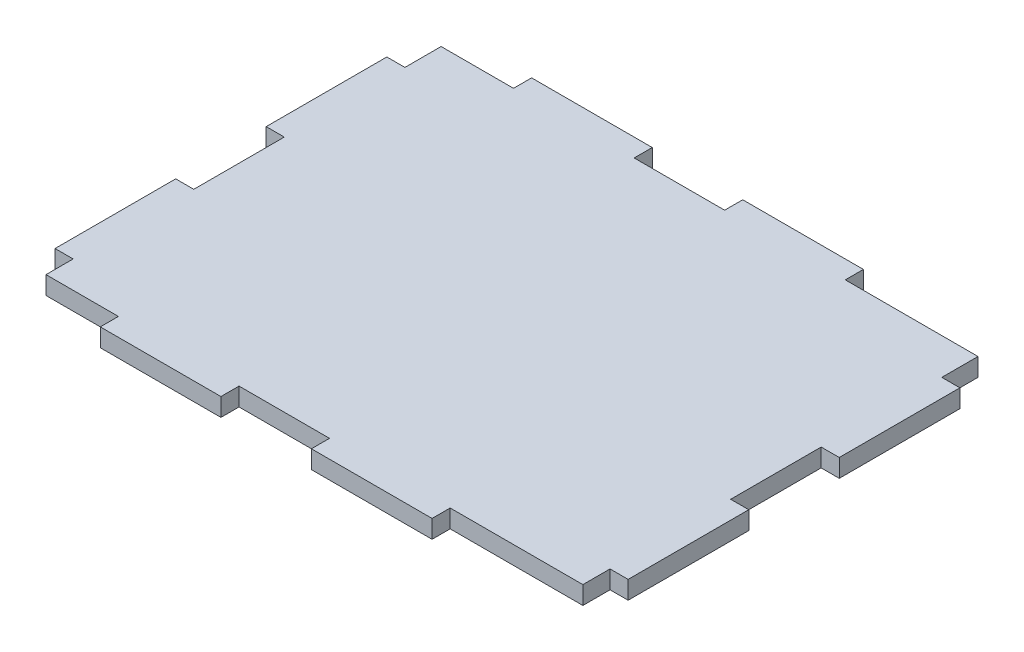
ISO-10303-21;
HEADER;
FILE_DESCRIPTION(('STEP AP214'),'2;1');
FILE_NAME('part.step','',(''),(''),'','','');
FILE_SCHEMA(('AUTOMOTIVE_DESIGN { 1 0 10303 214 1 1 1 1 }'));
ENDSEC;
DATA;
#1=APPLICATION_CONTEXT('core data for automotive mechanical design processes');
#2=APPLICATION_PROTOCOL_DEFINITION('international standard','automotive_design',2000,#1);
#3=PRODUCT_CONTEXT('',#1,'mechanical');
#4=PRODUCT('Part','Part','',(#3));
#5=PRODUCT_RELATED_PRODUCT_CATEGORY('part','',(#4));
#6=PRODUCT_DEFINITION_FORMATION('','',#4);
#7=PRODUCT_DEFINITION_CONTEXT('part definition',#1,'design');
#8=PRODUCT_DEFINITION('design','',#6,#7);
#9=PRODUCT_DEFINITION_SHAPE('','',#8);
#10=(LENGTH_UNIT() NAMED_UNIT(*) SI_UNIT(.MILLI.,.METRE.));
#11=(NAMED_UNIT(*) PLANE_ANGLE_UNIT() SI_UNIT($,.RADIAN.));
#12=(NAMED_UNIT(*) SI_UNIT($,.STERADIAN.) SOLID_ANGLE_UNIT());
#13=UNCERTAINTY_MEASURE_WITH_UNIT(LENGTH_MEASURE(1.E-05),#10,'distance_accuracy_value','');
#14=(GEOMETRIC_REPRESENTATION_CONTEXT(3) GLOBAL_UNCERTAINTY_ASSIGNED_CONTEXT((#13)) GLOBAL_UNIT_ASSIGNED_CONTEXT((#10,
#11,#12)) REPRESENTATION_CONTEXT('',''));
#15=CARTESIAN_POINT('',(0.,0.,0.));
#16=DIRECTION('',(0.,0.,1.));
#17=DIRECTION('',(1.,0.,0.));
#18=AXIS2_PLACEMENT_3D('',#15,#16,#17);
#19=CARTESIAN_POINT('',(89.,3.,0.));
#20=DIRECTION('',(-1.,0.,0.));
#21=DIRECTION('',(0.,0.,1.));
#22=AXIS2_PLACEMENT_3D('',#19,#20,#21);
#23=PLANE('',#22);
#24=DIRECTION('',(0.,0.,-1.));
#25=VECTOR('',#24,1.);
#26=CARTESIAN_POINT('',(89.,0.,0.));
#27=LINE('',#26,#25);
#28=CARTESIAN_POINT('',(89.,0.,0.));
#29=VERTEX_POINT('',#28);
#30=CARTESIAN_POINT('',(89.,0.,-4.50000000000002));
#31=VERTEX_POINT('',#30);
#32=EDGE_CURVE('E297',#29,#31,#27,.T.);
#33=ORIENTED_EDGE('',*,*,#32,.T.);
#34=DIRECTION('',(0.,-1.,0.));
#35=VECTOR('',#34,1.);
#36=CARTESIAN_POINT('',(89.,3.,-4.50000000000002));
#37=LINE('',#36,#35);
#38=CARTESIAN_POINT('',(89.,3.,-4.50000000000002));
#39=VERTEX_POINT('',#38);
#40=EDGE_CURVE('E11',#39,#31,#37,.T.);
#41=ORIENTED_EDGE('',*,*,#40,.F.);
#42=DIRECTION('',(0.,0.,-1.));
#43=VECTOR('',#42,1.);
#44=CARTESIAN_POINT('',(89.,3.,0.));
#45=LINE('',#44,#43);
#46=CARTESIAN_POINT('',(89.,3.,0.));
#47=VERTEX_POINT('',#46);
#48=EDGE_CURVE('E367',#47,#39,#45,.T.);
#49=ORIENTED_EDGE('',*,*,#48,.F.);
#50=DIRECTION('',(0.,-1.,0.));
#51=VECTOR('',#50,1.);
#52=CARTESIAN_POINT('',(89.,3.,0.));
#53=LINE('',#52,#51);
#54=EDGE_CURVE('E293',#47,#29,#53,.T.);
#55=ORIENTED_EDGE('',*,*,#54,.T.);
#56=EDGE_LOOP('',(#33,#41,#49,#55));
#57=FACE_BOUND('',#56,.T.);
#58=ADVANCED_FACE('F33',(#57),#23,.F.);
#59=CARTESIAN_POINT('',(89.,3.,-4.50000000000002));
#60=DIRECTION('',(0.,0.,-1.));
#61=DIRECTION('',(-1.,0.,0.));
#62=AXIS2_PLACEMENT_3D('',#59,#60,#61);
#63=PLANE('',#62);
#64=DIRECTION('',(1.,0.,0.));
#65=VECTOR('',#64,1.);
#66=CARTESIAN_POINT('',(89.,0.,-4.50000000000002));
#67=LINE('',#66,#65);
#68=CARTESIAN_POINT('',(92.,0.,-4.50000000000002));
#69=VERTEX_POINT('',#68);
#70=EDGE_CURVE('E300',#31,#69,#67,.T.);
#71=ORIENTED_EDGE('',*,*,#70,.T.);
#72=DIRECTION('',(0.,-1.,0.));
#73=VECTOR('',#72,1.);
#74=CARTESIAN_POINT('',(92.,3.,-4.50000000000002));
#75=LINE('',#74,#73);
#76=CARTESIAN_POINT('',(92.,3.,-4.50000000000002));
#77=VERTEX_POINT('',#76);
#78=EDGE_CURVE('E41',#77,#69,#75,.T.);
#79=ORIENTED_EDGE('',*,*,#78,.F.);
#80=DIRECTION('',(1.,0.,0.));
#81=VECTOR('',#80,1.);
#82=CARTESIAN_POINT('',(89.,3.,-4.50000000000002));
#83=LINE('',#82,#81);
#84=EDGE_CURVE('E176',#39,#77,#83,.T.);
#85=ORIENTED_EDGE('',*,*,#84,.F.);
#86=ORIENTED_EDGE('',*,*,#40,.T.);
#87=EDGE_LOOP('',(#71,#79,#85,#86));
#88=FACE_BOUND('',#87,.T.);
#89=ADVANCED_FACE('F565',(#88),#63,.F.);
#90=CARTESIAN_POINT('',(92.,3.,-4.50000000000002));
#91=DIRECTION('',(-1.,0.,0.));
#92=DIRECTION('',(0.,0.,1.));
#93=AXIS2_PLACEMENT_3D('',#90,#91,#92);
#94=PLANE('',#93);
#95=DIRECTION('',(0.,0.,-1.));
#96=VECTOR('',#95,1.);
#97=CARTESIAN_POINT('',(92.,0.,-4.50000000000002));
#98=LINE('',#97,#96);
#99=CARTESIAN_POINT('',(92.,0.,-24.5));
#100=VERTEX_POINT('',#99);
#101=EDGE_CURVE('E302',#69,#100,#98,.T.);
#102=ORIENTED_EDGE('',*,*,#101,.T.);
#103=DIRECTION('',(0.,-1.,0.));
#104=VECTOR('',#103,1.);
#105=CARTESIAN_POINT('',(92.,3.,-24.5));
#106=LINE('',#105,#104);
#107=CARTESIAN_POINT('',(92.,3.,-24.5));
#108=VERTEX_POINT('',#107);
#109=EDGE_CURVE('E458',#108,#100,#106,.T.);
#110=ORIENTED_EDGE('',*,*,#109,.F.);
#111=DIRECTION('',(0.,0.,-1.));
#112=VECTOR('',#111,1.);
#113=CARTESIAN_POINT('',(92.,3.,-4.50000000000002));
#114=LINE('',#113,#112);
#115=EDGE_CURVE('E466',#77,#108,#114,.T.);
#116=ORIENTED_EDGE('',*,*,#115,.F.);
#117=ORIENTED_EDGE('',*,*,#78,.T.);
#118=EDGE_LOOP('',(#102,#110,#116,#117));
#119=FACE_BOUND('',#118,.T.);
#120=ADVANCED_FACE('F464',(#119),#94,.F.);
#121=CARTESIAN_POINT('',(89.,3.,-24.5));
#122=DIRECTION('',(0.,0.,1.));
#123=DIRECTION('',(1.,0.,0.));
#124=AXIS2_PLACEMENT_3D('',#121,#122,#123);
#125=PLANE('',#124);
#126=DIRECTION('',(-1.,0.,0.));
#127=VECTOR('',#126,1.);
#128=CARTESIAN_POINT('',(89.,0.,-24.5));
#129=LINE('',#128,#127);
#130=CARTESIAN_POINT('',(89.,0.,-24.5));
#131=VERTEX_POINT('',#130);
#132=EDGE_CURVE('E304',#100,#131,#129,.T.);
#133=ORIENTED_EDGE('',*,*,#132,.T.);
#134=DIRECTION('',(0.,-1.,0.));
#135=VECTOR('',#134,1.);
#136=CARTESIAN_POINT('',(89.,3.,-24.5));
#137=LINE('',#136,#135);
#138=CARTESIAN_POINT('',(89.,3.,-24.5));
#139=VERTEX_POINT('',#138);
#140=EDGE_CURVE('E455',#139,#131,#137,.T.);
#141=ORIENTED_EDGE('',*,*,#140,.F.);
#142=DIRECTION('',(-1.,0.,0.));
#143=VECTOR('',#142,1.);
#144=CARTESIAN_POINT('',(89.,3.,-24.5));
#145=LINE('',#144,#143);
#146=EDGE_CURVE('E484',#108,#139,#145,.T.);
#147=ORIENTED_EDGE('',*,*,#146,.F.);
#148=ORIENTED_EDGE('',*,*,#109,.T.);
#149=EDGE_LOOP('',(#133,#141,#147,#148));
#150=FACE_BOUND('',#149,.T.);
#151=ADVANCED_FACE('F475',(#150),#125,.F.);
#152=CARTESIAN_POINT('',(89.,3.,-39.5));
#153=DIRECTION('',(-1.,0.,0.));
#154=DIRECTION('',(0.,0.,1.));
#155=AXIS2_PLACEMENT_3D('',#152,#153,#154);
#156=PLANE('',#155);
#157=DIRECTION('',(0.,0.,-1.));
#158=VECTOR('',#157,1.);
#159=CARTESIAN_POINT('',(89.,0.,-39.5));
#160=LINE('',#159,#158);
#161=CARTESIAN_POINT('',(89.,0.,-39.5));
#162=VERTEX_POINT('',#161);
#163=EDGE_CURVE('E306',#131,#162,#160,.T.);
#164=ORIENTED_EDGE('',*,*,#163,.T.);
#165=DIRECTION('',(0.,-1.,0.));
#166=VECTOR('',#165,1.);
#167=CARTESIAN_POINT('',(89.,3.,-39.5));
#168=LINE('',#167,#166);
#169=CARTESIAN_POINT('',(89.,3.,-39.5));
#170=VERTEX_POINT('',#169);
#171=EDGE_CURVE('E452',#170,#162,#168,.T.);
#172=ORIENTED_EDGE('',*,*,#171,.F.);
#173=DIRECTION('',(0.,0.,-1.));
#174=VECTOR('',#173,1.);
#175=CARTESIAN_POINT('',(89.,3.,-39.5));
#176=LINE('',#175,#174);
#177=EDGE_CURVE('E481',#139,#170,#176,.T.);
#178=ORIENTED_EDGE('',*,*,#177,.F.);
#179=ORIENTED_EDGE('',*,*,#140,.T.);
#180=EDGE_LOOP('',(#164,#172,#178,#179));
#181=FACE_BOUND('',#180,.T.);
#182=ADVANCED_FACE('F479',(#181),#156,.F.);
#183=CARTESIAN_POINT('',(89.,3.,-39.5));
#184=DIRECTION('',(0.,0.,-1.));
#185=DIRECTION('',(-1.,0.,0.));
#186=AXIS2_PLACEMENT_3D('',#183,#184,#185);
#187=PLANE('',#186);
#188=DIRECTION('',(1.,0.,0.));
#189=VECTOR('',#188,1.);
#190=CARTESIAN_POINT('',(89.,0.,-39.5));
#191=LINE('',#190,#189);
#192=CARTESIAN_POINT('',(92.,0.,-39.5));
#193=VERTEX_POINT('',#192);
#194=EDGE_CURVE('E308',#162,#193,#191,.T.);
#195=ORIENTED_EDGE('',*,*,#194,.T.);
#196=DIRECTION('',(0.,-1.,0.));
#197=VECTOR('',#196,1.);
#198=CARTESIAN_POINT('',(92.,3.,-39.5));
#199=LINE('',#198,#197);
#200=CARTESIAN_POINT('',(92.,3.,-39.5));
#201=VERTEX_POINT('',#200);
#202=EDGE_CURVE('E449',#201,#193,#199,.T.);
#203=ORIENTED_EDGE('',*,*,#202,.F.);
#204=DIRECTION('',(1.,0.,0.));
#205=VECTOR('',#204,1.);
#206=CARTESIAN_POINT('',(89.,3.,-39.5));
#207=LINE('',#206,#205);
#208=EDGE_CURVE('E483',#170,#201,#207,.T.);
#209=ORIENTED_EDGE('',*,*,#208,.F.);
#210=ORIENTED_EDGE('',*,*,#171,.T.);
#211=EDGE_LOOP('',(#195,#203,#209,#210));
#212=FACE_BOUND('',#211,.T.);
#213=ADVANCED_FACE('F578',(#212),#187,.F.);
#214=CARTESIAN_POINT('',(92.,3.,-59.5));
#215=DIRECTION('',(-1.,0.,0.));
#216=DIRECTION('',(0.,0.,1.));
#217=AXIS2_PLACEMENT_3D('',#214,#215,#216);
#218=PLANE('',#217);
#219=DIRECTION('',(0.,0.,-1.));
#220=VECTOR('',#219,1.);
#221=CARTESIAN_POINT('',(92.,0.,-59.5));
#222=LINE('',#221,#220);
#223=CARTESIAN_POINT('',(92.,0.,-59.5));
#224=VERTEX_POINT('',#223);
#225=EDGE_CURVE('E310',#193,#224,#222,.T.);
#226=ORIENTED_EDGE('',*,*,#225,.T.);
#227=DIRECTION('',(0.,-1.,0.));
#228=VECTOR('',#227,1.);
#229=CARTESIAN_POINT('',(92.,3.,-59.5));
#230=LINE('',#229,#228);
#231=CARTESIAN_POINT('',(92.,3.,-59.5));
#232=VERTEX_POINT('',#231);
#233=EDGE_CURVE('E446',#232,#224,#230,.T.);
#234=ORIENTED_EDGE('',*,*,#233,.F.);
#235=DIRECTION('',(0.,0.,-1.));
#236=VECTOR('',#235,1.);
#237=CARTESIAN_POINT('',(92.,3.,-59.5));
#238=LINE('',#237,#236);
#239=EDGE_CURVE('E486',#201,#232,#238,.T.);
#240=ORIENTED_EDGE('',*,*,#239,.F.);
#241=ORIENTED_EDGE('',*,*,#202,.T.);
#242=EDGE_LOOP('',(#226,#234,#240,#241));
#243=FACE_BOUND('',#242,.T.);
#244=ADVANCED_FACE('F581',(#243),#218,.F.);
#245=CARTESIAN_POINT('',(89.,3.,-59.5));
#246=DIRECTION('',(0.,0.,1.));
#247=DIRECTION('',(1.,0.,0.));
#248=AXIS2_PLACEMENT_3D('',#245,#246,#247);
#249=PLANE('',#248);
#250=DIRECTION('',(-1.,0.,0.));
#251=VECTOR('',#250,1.);
#252=CARTESIAN_POINT('',(89.,0.,-59.5));
#253=LINE('',#252,#251);
#254=CARTESIAN_POINT('',(89.,0.,-59.5));
#255=VERTEX_POINT('',#254);
#256=EDGE_CURVE('E312',#224,#255,#253,.T.);
#257=ORIENTED_EDGE('',*,*,#256,.T.);
#258=DIRECTION('',(0.,-1.,0.));
#259=VECTOR('',#258,1.);
#260=CARTESIAN_POINT('',(89.,3.,-59.5));
#261=LINE('',#260,#259);
#262=CARTESIAN_POINT('',(89.,3.,-59.5));
#263=VERTEX_POINT('',#262);
#264=EDGE_CURVE('E443',#263,#255,#261,.T.);
#265=ORIENTED_EDGE('',*,*,#264,.F.);
#266=DIRECTION('',(-1.,0.,0.));
#267=VECTOR('',#266,1.);
#268=CARTESIAN_POINT('',(89.,3.,-59.5));
#269=LINE('',#268,#267);
#270=EDGE_CURVE('E492',#232,#263,#269,.T.);
#271=ORIENTED_EDGE('',*,*,#270,.F.);
#272=ORIENTED_EDGE('',*,*,#233,.T.);
#273=EDGE_LOOP('',(#257,#265,#271,#272));
#274=FACE_BOUND('',#273,.T.);
#275=ADVANCED_FACE('F585',(#274),#249,.F.);
#276=CARTESIAN_POINT('',(89.,3.,-59.5));
#277=DIRECTION('',(-1.,0.,0.));
#278=DIRECTION('',(0.,0.,1.));
#279=AXIS2_PLACEMENT_3D('',#276,#277,#278);
#280=PLANE('',#279);
#281=DIRECTION('',(0.,0.,-1.));
#282=VECTOR('',#281,1.);
#283=CARTESIAN_POINT('',(89.,0.,-59.5));
#284=LINE('',#283,#282);
#285=CARTESIAN_POINT('',(89.,0.,-65.5));
#286=VERTEX_POINT('',#285);
#287=EDGE_CURVE('E314',#255,#286,#284,.T.);
#288=ORIENTED_EDGE('',*,*,#287,.T.);
#289=DIRECTION('',(0.,-1.,0.));
#290=VECTOR('',#289,1.);
#291=CARTESIAN_POINT('',(89.,3.,-65.5));
#292=LINE('',#291,#290);
#293=CARTESIAN_POINT('',(89.,3.,-65.5));
#294=VERTEX_POINT('',#293);
#295=EDGE_CURVE('E440',#294,#286,#292,.T.);
#296=ORIENTED_EDGE('',*,*,#295,.F.);
#297=DIRECTION('',(0.,0.,-1.));
#298=VECTOR('',#297,1.);
#299=CARTESIAN_POINT('',(89.,3.,-59.5));
#300=LINE('',#299,#298);
#301=EDGE_CURVE('E494',#263,#294,#300,.T.);
#302=ORIENTED_EDGE('',*,*,#301,.F.);
#303=ORIENTED_EDGE('',*,*,#264,.T.);
#304=EDGE_LOOP('',(#288,#296,#302,#303));
#305=FACE_BOUND('',#304,.T.);
#306=ADVANCED_FACE('F589',(#305),#280,.F.);
#307=CARTESIAN_POINT('',(89.,3.,-65.5));
#308=DIRECTION('',(0.,0.,1.));
#309=DIRECTION('',(1.,0.,0.));
#310=AXIS2_PLACEMENT_3D('',#307,#308,#309);
#311=PLANE('',#310);
#312=DIRECTION('',(-1.,0.,0.));
#313=VECTOR('',#312,1.);
#314=CARTESIAN_POINT('',(89.,0.,-65.5));
#315=LINE('',#314,#313);
#316=CARTESIAN_POINT('',(67.,0.,-65.5));
#317=VERTEX_POINT('',#316);
#318=EDGE_CURVE('E316',#286,#317,#315,.T.);
#319=ORIENTED_EDGE('',*,*,#318,.T.);
#320=DIRECTION('',(0.,-1.,0.));
#321=VECTOR('',#320,1.);
#322=CARTESIAN_POINT('',(67.,3.,-65.5));
#323=LINE('',#322,#321);
#324=CARTESIAN_POINT('',(67.,3.,-65.5));
#325=VERTEX_POINT('',#324);
#326=EDGE_CURVE('E437',#325,#317,#323,.T.);
#327=ORIENTED_EDGE('',*,*,#326,.F.);
#328=DIRECTION('',(-1.,0.,0.));
#329=VECTOR('',#328,1.);
#330=CARTESIAN_POINT('',(89.,3.,-65.5));
#331=LINE('',#330,#329);
#332=EDGE_CURVE('E496',#294,#325,#331,.T.);
#333=ORIENTED_EDGE('',*,*,#332,.F.);
#334=ORIENTED_EDGE('',*,*,#295,.T.);
#335=EDGE_LOOP('',(#319,#327,#333,#334));
#336=FACE_BOUND('',#335,.T.);
#337=ADVANCED_FACE('F593',(#336),#311,.F.);
#338=CARTESIAN_POINT('',(67.,3.,-65.5));
#339=DIRECTION('',(-1.,0.,0.));
#340=DIRECTION('',(0.,0.,1.));
#341=AXIS2_PLACEMENT_3D('',#338,#339,#340);
#342=PLANE('',#341);
#343=DIRECTION('',(0.,0.,-1.));
#344=VECTOR('',#343,1.);
#345=CARTESIAN_POINT('',(67.,0.,-65.5));
#346=LINE('',#345,#344);
#347=CARTESIAN_POINT('',(67.,0.,-68.5));
#348=VERTEX_POINT('',#347);
#349=EDGE_CURVE('E318',#317,#348,#346,.T.);
#350=ORIENTED_EDGE('',*,*,#349,.T.);
#351=DIRECTION('',(0.,-1.,0.));
#352=VECTOR('',#351,1.);
#353=CARTESIAN_POINT('',(67.,3.,-68.5));
#354=LINE('',#353,#352);
#355=CARTESIAN_POINT('',(67.,3.,-68.5));
#356=VERTEX_POINT('',#355);
#357=EDGE_CURVE('E434',#356,#348,#354,.T.);
#358=ORIENTED_EDGE('',*,*,#357,.F.);
#359=DIRECTION('',(0.,0.,-1.));
#360=VECTOR('',#359,1.);
#361=CARTESIAN_POINT('',(67.,3.,-65.5));
#362=LINE('',#361,#360);
#363=EDGE_CURVE('E498',#325,#356,#362,.T.);
#364=ORIENTED_EDGE('',*,*,#363,.F.);
#365=ORIENTED_EDGE('',*,*,#326,.T.);
#366=EDGE_LOOP('',(#350,#358,#364,#365));
#367=FACE_BOUND('',#366,.T.);
#368=ADVANCED_FACE('F597',(#367),#342,.F.);
#369=CARTESIAN_POINT('',(47.,3.,-68.5));
#370=DIRECTION('',(0.,0.,1.));
#371=DIRECTION('',(1.,0.,0.));
#372=AXIS2_PLACEMENT_3D('',#369,#370,#371);
#373=PLANE('',#372);
#374=DIRECTION('',(-1.,0.,0.));
#375=VECTOR('',#374,1.);
#376=CARTESIAN_POINT('',(47.,0.,-68.5));
#377=LINE('',#376,#375);
#378=CARTESIAN_POINT('',(47.,0.,-68.5));
#379=VERTEX_POINT('',#378);
#380=EDGE_CURVE('E320',#348,#379,#377,.T.);
#381=ORIENTED_EDGE('',*,*,#380,.T.);
#382=DIRECTION('',(0.,-1.,0.));
#383=VECTOR('',#382,1.);
#384=CARTESIAN_POINT('',(47.,3.,-68.5));
#385=LINE('',#384,#383);
#386=CARTESIAN_POINT('',(47.,3.,-68.5));
#387=VERTEX_POINT('',#386);
#388=EDGE_CURVE('E431',#387,#379,#385,.T.);
#389=ORIENTED_EDGE('',*,*,#388,.F.);
#390=DIRECTION('',(-1.,0.,0.));
#391=VECTOR('',#390,1.);
#392=CARTESIAN_POINT('',(47.,3.,-68.5));
#393=LINE('',#392,#391);
#394=EDGE_CURVE('E500',#356,#387,#393,.T.);
#395=ORIENTED_EDGE('',*,*,#394,.F.);
#396=ORIENTED_EDGE('',*,*,#357,.T.);
#397=EDGE_LOOP('',(#381,#389,#395,#396));
#398=FACE_BOUND('',#397,.T.);
#399=ADVANCED_FACE('F601',(#398),#373,.F.);
#400=CARTESIAN_POINT('',(47.,3.,-65.5));
#401=DIRECTION('',(1.,0.,0.));
#402=DIRECTION('',(0.,0.,-1.));
#403=AXIS2_PLACEMENT_3D('',#400,#401,#402);
#404=PLANE('',#403);
#405=DIRECTION('',(0.,0.,1.));
#406=VECTOR('',#405,1.);
#407=CARTESIAN_POINT('',(47.,0.,-65.5));
#408=LINE('',#407,#406);
#409=CARTESIAN_POINT('',(47.,0.,-65.5));
#410=VERTEX_POINT('',#409);
#411=EDGE_CURVE('E322',#379,#410,#408,.T.);
#412=ORIENTED_EDGE('',*,*,#411,.T.);
#413=DIRECTION('',(0.,-1.,0.));
#414=VECTOR('',#413,1.);
#415=CARTESIAN_POINT('',(47.,3.,-65.5));
#416=LINE('',#415,#414);
#417=CARTESIAN_POINT('',(47.,3.,-65.5));
#418=VERTEX_POINT('',#417);
#419=EDGE_CURVE('E428',#418,#410,#416,.T.);
#420=ORIENTED_EDGE('',*,*,#419,.F.);
#421=DIRECTION('',(0.,0.,1.));
#422=VECTOR('',#421,1.);
#423=CARTESIAN_POINT('',(47.,3.,-65.5));
#424=LINE('',#423,#422);
#425=EDGE_CURVE('E502',#387,#418,#424,.T.);
#426=ORIENTED_EDGE('',*,*,#425,.F.);
#427=ORIENTED_EDGE('',*,*,#388,.T.);
#428=EDGE_LOOP('',(#412,#420,#426,#427));
#429=FACE_BOUND('',#428,.T.);
#430=ADVANCED_FACE('F605',(#429),#404,.F.);
#431=CARTESIAN_POINT('',(47.,3.,-65.5));
#432=DIRECTION('',(0.,0.,1.));
#433=DIRECTION('',(1.,0.,0.));
#434=AXIS2_PLACEMENT_3D('',#431,#432,#433);
#435=PLANE('',#434);
#436=DIRECTION('',(-1.,0.,0.));
#437=VECTOR('',#436,1.);
#438=CARTESIAN_POINT('',(47.,0.,-65.5));
#439=LINE('',#438,#437);
#440=CARTESIAN_POINT('',(32.,0.,-65.5));
#441=VERTEX_POINT('',#440);
#442=EDGE_CURVE('E324',#410,#441,#439,.T.);
#443=ORIENTED_EDGE('',*,*,#442,.T.);
#444=DIRECTION('',(0.,-1.,0.));
#445=VECTOR('',#444,1.);
#446=CARTESIAN_POINT('',(32.,3.,-65.5));
#447=LINE('',#446,#445);
#448=CARTESIAN_POINT('',(32.,3.,-65.5));
#449=VERTEX_POINT('',#448);
#450=EDGE_CURVE('E425',#449,#441,#447,.T.);
#451=ORIENTED_EDGE('',*,*,#450,.F.);
#452=DIRECTION('',(-1.,0.,0.));
#453=VECTOR('',#452,1.);
#454=CARTESIAN_POINT('',(47.,3.,-65.5));
#455=LINE('',#454,#453);
#456=EDGE_CURVE('E504',#418,#449,#455,.T.);
#457=ORIENTED_EDGE('',*,*,#456,.F.);
#458=ORIENTED_EDGE('',*,*,#419,.T.);
#459=EDGE_LOOP('',(#443,#451,#457,#458));
#460=FACE_BOUND('',#459,.T.);
#461=ADVANCED_FACE('F609',(#460),#435,.F.);
#462=CARTESIAN_POINT('',(32.,3.,-65.5));
#463=DIRECTION('',(-1.,0.,0.));
#464=DIRECTION('',(0.,0.,1.));
#465=AXIS2_PLACEMENT_3D('',#462,#463,#464);
#466=PLANE('',#465);
#467=DIRECTION('',(0.,0.,-1.));
#468=VECTOR('',#467,1.);
#469=CARTESIAN_POINT('',(32.,0.,-65.5));
#470=LINE('',#469,#468);
#471=CARTESIAN_POINT('',(32.,0.,-68.5));
#472=VERTEX_POINT('',#471);
#473=EDGE_CURVE('E326',#441,#472,#470,.T.);
#474=ORIENTED_EDGE('',*,*,#473,.T.);
#475=DIRECTION('',(0.,-1.,0.));
#476=VECTOR('',#475,1.);
#477=CARTESIAN_POINT('',(32.,3.,-68.5));
#478=LINE('',#477,#476);
#479=CARTESIAN_POINT('',(32.,3.,-68.5));
#480=VERTEX_POINT('',#479);
#481=EDGE_CURVE('E422',#480,#472,#478,.T.);
#482=ORIENTED_EDGE('',*,*,#481,.F.);
#483=DIRECTION('',(0.,0.,-1.));
#484=VECTOR('',#483,1.);
#485=CARTESIAN_POINT('',(32.,3.,-65.5));
#486=LINE('',#485,#484);
#487=EDGE_CURVE('E506',#449,#480,#486,.T.);
#488=ORIENTED_EDGE('',*,*,#487,.F.);
#489=ORIENTED_EDGE('',*,*,#450,.T.);
#490=EDGE_LOOP('',(#474,#482,#488,#489));
#491=FACE_BOUND('',#490,.T.);
#492=ADVANCED_FACE('F613',(#491),#466,.F.);
#493=CARTESIAN_POINT('',(12.,3.,-68.5));
#494=DIRECTION('',(0.,0.,1.));
#495=DIRECTION('',(1.,0.,0.));
#496=AXIS2_PLACEMENT_3D('',#493,#494,#495);
#497=PLANE('',#496);
#498=DIRECTION('',(-1.,0.,0.));
#499=VECTOR('',#498,1.);
#500=CARTESIAN_POINT('',(12.,0.,-68.5));
#501=LINE('',#500,#499);
#502=CARTESIAN_POINT('',(12.,0.,-68.5));
#503=VERTEX_POINT('',#502);
#504=EDGE_CURVE('E328',#472,#503,#501,.T.);
#505=ORIENTED_EDGE('',*,*,#504,.T.);
#506=DIRECTION('',(0.,-1.,0.));
#507=VECTOR('',#506,1.);
#508=CARTESIAN_POINT('',(12.,3.,-68.5));
#509=LINE('',#508,#507);
#510=CARTESIAN_POINT('',(12.,3.,-68.5));
#511=VERTEX_POINT('',#510);
#512=EDGE_CURVE('E419',#511,#503,#509,.T.);
#513=ORIENTED_EDGE('',*,*,#512,.F.);
#514=DIRECTION('',(-1.,0.,0.));
#515=VECTOR('',#514,1.);
#516=CARTESIAN_POINT('',(12.,3.,-68.5));
#517=LINE('',#516,#515);
#518=EDGE_CURVE('E508',#480,#511,#517,.T.);
#519=ORIENTED_EDGE('',*,*,#518,.F.);
#520=ORIENTED_EDGE('',*,*,#481,.T.);
#521=EDGE_LOOP('',(#505,#513,#519,#520));
#522=FACE_BOUND('',#521,.T.);
#523=ADVANCED_FACE('F617',(#522),#497,.F.);
#524=CARTESIAN_POINT('',(12.,3.,-65.5));
#525=DIRECTION('',(1.,0.,0.));
#526=DIRECTION('',(0.,0.,-1.));
#527=AXIS2_PLACEMENT_3D('',#524,#525,#526);
#528=PLANE('',#527);
#529=DIRECTION('',(0.,0.,1.));
#530=VECTOR('',#529,1.);
#531=CARTESIAN_POINT('',(12.,0.,-65.5));
#532=LINE('',#531,#530);
#533=CARTESIAN_POINT('',(12.,0.,-65.5));
#534=VERTEX_POINT('',#533);
#535=EDGE_CURVE('E330',#503,#534,#532,.T.);
#536=ORIENTED_EDGE('',*,*,#535,.T.);
#537=DIRECTION('',(0.,-1.,0.));
#538=VECTOR('',#537,1.);
#539=CARTESIAN_POINT('',(12.,3.,-65.5));
#540=LINE('',#539,#538);
#541=CARTESIAN_POINT('',(12.,3.,-65.5));
#542=VERTEX_POINT('',#541);
#543=EDGE_CURVE('E416',#542,#534,#540,.T.);
#544=ORIENTED_EDGE('',*,*,#543,.F.);
#545=DIRECTION('',(0.,0.,1.));
#546=VECTOR('',#545,1.);
#547=CARTESIAN_POINT('',(12.,3.,-65.5));
#548=LINE('',#547,#546);
#549=EDGE_CURVE('E510',#511,#542,#548,.T.);
#550=ORIENTED_EDGE('',*,*,#549,.F.);
#551=ORIENTED_EDGE('',*,*,#512,.T.);
#552=EDGE_LOOP('',(#536,#544,#550,#551));
#553=FACE_BOUND('',#552,.T.);
#554=ADVANCED_FACE('F621',(#553),#528,.F.);
#555=CARTESIAN_POINT('',(12.,3.,-65.5));
#556=DIRECTION('',(0.,0.,1.));
#557=DIRECTION('',(1.,0.,0.));
#558=AXIS2_PLACEMENT_3D('',#555,#556,#557);
#559=PLANE('',#558);
#560=DIRECTION('',(-1.,0.,0.));
#561=VECTOR('',#560,1.);
#562=CARTESIAN_POINT('',(12.,0.,-65.5));
#563=LINE('',#562,#561);
#564=CARTESIAN_POINT('',(0.,0.,-65.5));
#565=VERTEX_POINT('',#564);
#566=EDGE_CURVE('E332',#534,#565,#563,.T.);
#567=ORIENTED_EDGE('',*,*,#566,.T.);
#568=DIRECTION('',(0.,-1.,0.));
#569=VECTOR('',#568,1.);
#570=CARTESIAN_POINT('',(0.,3.,-65.5));
#571=LINE('',#570,#569);
#572=CARTESIAN_POINT('',(0.,3.,-65.5));
#573=VERTEX_POINT('',#572);
#574=EDGE_CURVE('E413',#573,#565,#571,.T.);
#575=ORIENTED_EDGE('',*,*,#574,.F.);
#576=DIRECTION('',(-1.,0.,0.));
#577=VECTOR('',#576,1.);
#578=CARTESIAN_POINT('',(12.,3.,-65.5));
#579=LINE('',#578,#577);
#580=EDGE_CURVE('E512',#542,#573,#579,.T.);
#581=ORIENTED_EDGE('',*,*,#580,.F.);
#582=ORIENTED_EDGE('',*,*,#543,.T.);
#583=EDGE_LOOP('',(#567,#575,#581,#582));
#584=FACE_BOUND('',#583,.T.);
#585=ADVANCED_FACE('F625',(#584),#559,.F.);
#586=CARTESIAN_POINT('',(0.,3.,-59.5));
#587=DIRECTION('',(1.,0.,0.));
#588=DIRECTION('',(0.,0.,-1.));
#589=AXIS2_PLACEMENT_3D('',#586,#587,#588);
#590=PLANE('',#589);
#591=DIRECTION('',(0.,0.,1.));
#592=VECTOR('',#591,1.);
#593=CARTESIAN_POINT('',(0.,0.,-59.5));
#594=LINE('',#593,#592);
#595=CARTESIAN_POINT('',(0.,0.,-59.5));
#596=VERTEX_POINT('',#595);
#597=EDGE_CURVE('E334',#565,#596,#594,.T.);
#598=ORIENTED_EDGE('',*,*,#597,.T.);
#599=DIRECTION('',(0.,-1.,0.));
#600=VECTOR('',#599,1.);
#601=CARTESIAN_POINT('',(0.,3.,-59.5));
#602=LINE('',#601,#600);
#603=CARTESIAN_POINT('',(0.,3.,-59.5));
#604=VERTEX_POINT('',#603);
#605=EDGE_CURVE('E410',#604,#596,#602,.T.);
#606=ORIENTED_EDGE('',*,*,#605,.F.);
#607=DIRECTION('',(0.,0.,1.));
#608=VECTOR('',#607,1.);
#609=CARTESIAN_POINT('',(0.,3.,-59.5));
#610=LINE('',#609,#608);
#611=EDGE_CURVE('E514',#573,#604,#610,.T.);
#612=ORIENTED_EDGE('',*,*,#611,.F.);
#613=ORIENTED_EDGE('',*,*,#574,.T.);
#614=EDGE_LOOP('',(#598,#606,#612,#613));
#615=FACE_BOUND('',#614,.T.);
#616=ADVANCED_FACE('F629',(#615),#590,.F.);
#617=CARTESIAN_POINT('',(0.,3.,-59.5));
#618=DIRECTION('',(0.,0.,1.));
#619=DIRECTION('',(1.,0.,0.));
#620=AXIS2_PLACEMENT_3D('',#617,#618,#619);
#621=PLANE('',#620);
#622=DIRECTION('',(-1.,0.,0.));
#623=VECTOR('',#622,1.);
#624=CARTESIAN_POINT('',(0.,0.,-59.5));
#625=LINE('',#624,#623);
#626=CARTESIAN_POINT('',(-3.,0.,-59.5));
#627=VERTEX_POINT('',#626);
#628=EDGE_CURVE('E336',#596,#627,#625,.T.);
#629=ORIENTED_EDGE('',*,*,#628,.T.);
#630=DIRECTION('',(0.,-1.,0.));
#631=VECTOR('',#630,1.);
#632=CARTESIAN_POINT('',(-3.,3.,-59.5));
#633=LINE('',#632,#631);
#634=CARTESIAN_POINT('',(-3.,3.,-59.5));
#635=VERTEX_POINT('',#634);
#636=EDGE_CURVE('E407',#635,#627,#633,.T.);
#637=ORIENTED_EDGE('',*,*,#636,.F.);
#638=DIRECTION('',(-1.,0.,0.));
#639=VECTOR('',#638,1.);
#640=CARTESIAN_POINT('',(0.,3.,-59.5));
#641=LINE('',#640,#639);
#642=EDGE_CURVE('E516',#604,#635,#641,.T.);
#643=ORIENTED_EDGE('',*,*,#642,.F.);
#644=ORIENTED_EDGE('',*,*,#605,.T.);
#645=EDGE_LOOP('',(#629,#637,#643,#644));
#646=FACE_BOUND('',#645,.T.);
#647=ADVANCED_FACE('F633',(#646),#621,.F.);
#648=CARTESIAN_POINT('',(-3.,3.,-59.5));
#649=DIRECTION('',(1.,0.,0.));
#650=DIRECTION('',(0.,0.,-1.));
#651=AXIS2_PLACEMENT_3D('',#648,#649,#650);
#652=PLANE('',#651);
#653=DIRECTION('',(0.,0.,1.));
#654=VECTOR('',#653,1.);
#655=CARTESIAN_POINT('',(-3.,0.,-59.5));
#656=LINE('',#655,#654);
#657=CARTESIAN_POINT('',(-3.,0.,-39.5));
#658=VERTEX_POINT('',#657);
#659=EDGE_CURVE('E338',#627,#658,#656,.T.);
#660=ORIENTED_EDGE('',*,*,#659,.T.);
#661=DIRECTION('',(0.,-1.,0.));
#662=VECTOR('',#661,1.);
#663=CARTESIAN_POINT('',(-3.,3.,-39.5));
#664=LINE('',#663,#662);
#665=CARTESIAN_POINT('',(-3.,3.,-39.5));
#666=VERTEX_POINT('',#665);
#667=EDGE_CURVE('E404',#666,#658,#664,.T.);
#668=ORIENTED_EDGE('',*,*,#667,.F.);
#669=DIRECTION('',(0.,0.,1.));
#670=VECTOR('',#669,1.);
#671=CARTESIAN_POINT('',(-3.,3.,-59.5));
#672=LINE('',#671,#670);
#673=EDGE_CURVE('E518',#635,#666,#672,.T.);
#674=ORIENTED_EDGE('',*,*,#673,.F.);
#675=ORIENTED_EDGE('',*,*,#636,.T.);
#676=EDGE_LOOP('',(#660,#668,#674,#675));
#677=FACE_BOUND('',#676,.T.);
#678=ADVANCED_FACE('F637',(#677),#652,.F.);
#679=CARTESIAN_POINT('',(0.,3.,-39.5));
#680=DIRECTION('',(0.,0.,-1.));
#681=DIRECTION('',(-1.,0.,0.));
#682=AXIS2_PLACEMENT_3D('',#679,#680,#681);
#683=PLANE('',#682);
#684=DIRECTION('',(1.,0.,0.));
#685=VECTOR('',#684,1.);
#686=CARTESIAN_POINT('',(0.,0.,-39.5));
#687=LINE('',#686,#685);
#688=CARTESIAN_POINT('',(0.,0.,-39.5));
#689=VERTEX_POINT('',#688);
#690=EDGE_CURVE('E340',#658,#689,#687,.T.);
#691=ORIENTED_EDGE('',*,*,#690,.T.);
#692=DIRECTION('',(0.,-1.,0.));
#693=VECTOR('',#692,1.);
#694=CARTESIAN_POINT('',(0.,3.,-39.5));
#695=LINE('',#694,#693);
#696=CARTESIAN_POINT('',(0.,3.,-39.5));
#697=VERTEX_POINT('',#696);
#698=EDGE_CURVE('E401',#697,#689,#695,.T.);
#699=ORIENTED_EDGE('',*,*,#698,.F.);
#700=DIRECTION('',(1.,0.,0.));
#701=VECTOR('',#700,1.);
#702=CARTESIAN_POINT('',(0.,3.,-39.5));
#703=LINE('',#702,#701);
#704=EDGE_CURVE('E520',#666,#697,#703,.T.);
#705=ORIENTED_EDGE('',*,*,#704,.F.);
#706=ORIENTED_EDGE('',*,*,#667,.T.);
#707=EDGE_LOOP('',(#691,#699,#705,#706));
#708=FACE_BOUND('',#707,.T.);
#709=ADVANCED_FACE('F641',(#708),#683,.F.);
#710=CARTESIAN_POINT('',(0.,3.,-39.5));
#711=DIRECTION('',(1.,0.,0.));
#712=DIRECTION('',(0.,0.,-1.));
#713=AXIS2_PLACEMENT_3D('',#710,#711,#712);
#714=PLANE('',#713);
#715=DIRECTION('',(0.,0.,1.));
#716=VECTOR('',#715,1.);
#717=CARTESIAN_POINT('',(0.,0.,-39.5));
#718=LINE('',#717,#716);
#719=CARTESIAN_POINT('',(0.,0.,-24.5));
#720=VERTEX_POINT('',#719);
#721=EDGE_CURVE('E342',#689,#720,#718,.T.);
#722=ORIENTED_EDGE('',*,*,#721,.T.);
#723=DIRECTION('',(0.,-1.,0.));
#724=VECTOR('',#723,1.);
#725=CARTESIAN_POINT('',(0.,3.,-24.5));
#726=LINE('',#725,#724);
#727=CARTESIAN_POINT('',(0.,3.,-24.5));
#728=VERTEX_POINT('',#727);
#729=EDGE_CURVE('E398',#728,#720,#726,.T.);
#730=ORIENTED_EDGE('',*,*,#729,.F.);
#731=DIRECTION('',(0.,0.,1.));
#732=VECTOR('',#731,1.);
#733=CARTESIAN_POINT('',(0.,3.,-39.5));
#734=LINE('',#733,#732);
#735=EDGE_CURVE('E522',#697,#728,#734,.T.);
#736=ORIENTED_EDGE('',*,*,#735,.F.);
#737=ORIENTED_EDGE('',*,*,#698,.T.);
#738=EDGE_LOOP('',(#722,#730,#736,#737));
#739=FACE_BOUND('',#738,.T.);
#740=ADVANCED_FACE('F645',(#739),#714,.F.);
#741=CARTESIAN_POINT('',(0.,3.,-24.5));
#742=DIRECTION('',(0.,0.,1.));
#743=DIRECTION('',(1.,0.,0.));
#744=AXIS2_PLACEMENT_3D('',#741,#742,#743);
#745=PLANE('',#744);
#746=DIRECTION('',(-1.,0.,0.));
#747=VECTOR('',#746,1.);
#748=CARTESIAN_POINT('',(0.,0.,-24.5));
#749=LINE('',#748,#747);
#750=CARTESIAN_POINT('',(-3.,0.,-24.5));
#751=VERTEX_POINT('',#750);
#752=EDGE_CURVE('E344',#720,#751,#749,.T.);
#753=ORIENTED_EDGE('',*,*,#752,.T.);
#754=DIRECTION('',(0.,-1.,0.));
#755=VECTOR('',#754,1.);
#756=CARTESIAN_POINT('',(-3.,3.,-24.5));
#757=LINE('',#756,#755);
#758=CARTESIAN_POINT('',(-3.,3.,-24.5));
#759=VERTEX_POINT('',#758);
#760=EDGE_CURVE('E395',#759,#751,#757,.T.);
#761=ORIENTED_EDGE('',*,*,#760,.F.);
#762=DIRECTION('',(-1.,0.,0.));
#763=VECTOR('',#762,1.);
#764=CARTESIAN_POINT('',(0.,3.,-24.5));
#765=LINE('',#764,#763);
#766=EDGE_CURVE('E524',#728,#759,#765,.T.);
#767=ORIENTED_EDGE('',*,*,#766,.F.);
#768=ORIENTED_EDGE('',*,*,#729,.T.);
#769=EDGE_LOOP('',(#753,#761,#767,#768));
#770=FACE_BOUND('',#769,.T.);
#771=ADVANCED_FACE('F649',(#770),#745,.F.);
#772=CARTESIAN_POINT('',(-3.,3.,-24.5));
#773=DIRECTION('',(1.,0.,0.));
#774=DIRECTION('',(0.,0.,-1.));
#775=AXIS2_PLACEMENT_3D('',#772,#773,#774);
#776=PLANE('',#775);
#777=DIRECTION('',(0.,0.,1.));
#778=VECTOR('',#777,1.);
#779=CARTESIAN_POINT('',(-3.,0.,-24.5));
#780=LINE('',#779,#778);
#781=CARTESIAN_POINT('',(-3.,0.,-4.50000000000002));
#782=VERTEX_POINT('',#781);
#783=EDGE_CURVE('E346',#751,#782,#780,.T.);
#784=ORIENTED_EDGE('',*,*,#783,.T.);
#785=DIRECTION('',(0.,-1.,0.));
#786=VECTOR('',#785,1.);
#787=CARTESIAN_POINT('',(-3.,3.,-4.50000000000002));
#788=LINE('',#787,#786);
#789=CARTESIAN_POINT('',(-3.,3.,-4.50000000000002));
#790=VERTEX_POINT('',#789);
#791=EDGE_CURVE('E392',#790,#782,#788,.T.);
#792=ORIENTED_EDGE('',*,*,#791,.F.);
#793=DIRECTION('',(0.,0.,1.));
#794=VECTOR('',#793,1.);
#795=CARTESIAN_POINT('',(-3.,3.,-24.5));
#796=LINE('',#795,#794);
#797=EDGE_CURVE('E526',#759,#790,#796,.T.);
#798=ORIENTED_EDGE('',*,*,#797,.F.);
#799=ORIENTED_EDGE('',*,*,#760,.T.);
#800=EDGE_LOOP('',(#784,#792,#798,#799));
#801=FACE_BOUND('',#800,.T.);
#802=ADVANCED_FACE('F653',(#801),#776,.F.);
#803=CARTESIAN_POINT('',(0.,3.,-4.50000000000002));
#804=DIRECTION('',(0.,0.,-1.));
#805=DIRECTION('',(-1.,0.,0.));
#806=AXIS2_PLACEMENT_3D('',#803,#804,#805);
#807=PLANE('',#806);
#808=DIRECTION('',(1.,0.,0.));
#809=VECTOR('',#808,1.);
#810=CARTESIAN_POINT('',(0.,0.,-4.50000000000002));
#811=LINE('',#810,#809);
#812=CARTESIAN_POINT('',(0.,0.,-4.50000000000002));
#813=VERTEX_POINT('',#812);
#814=EDGE_CURVE('E348',#782,#813,#811,.T.);
#815=ORIENTED_EDGE('',*,*,#814,.T.);
#816=DIRECTION('',(0.,-1.,0.));
#817=VECTOR('',#816,1.);
#818=CARTESIAN_POINT('',(0.,3.,-4.50000000000002));
#819=LINE('',#818,#817);
#820=CARTESIAN_POINT('',(0.,3.,-4.50000000000002));
#821=VERTEX_POINT('',#820);
#822=EDGE_CURVE('E389',#821,#813,#819,.T.);
#823=ORIENTED_EDGE('',*,*,#822,.F.);
#824=DIRECTION('',(1.,0.,0.));
#825=VECTOR('',#824,1.);
#826=CARTESIAN_POINT('',(0.,3.,-4.50000000000002));
#827=LINE('',#826,#825);
#828=EDGE_CURVE('E528',#790,#821,#827,.T.);
#829=ORIENTED_EDGE('',*,*,#828,.F.);
#830=ORIENTED_EDGE('',*,*,#791,.T.);
#831=EDGE_LOOP('',(#815,#823,#829,#830));
#832=FACE_BOUND('',#831,.T.);
#833=ADVANCED_FACE('F657',(#832),#807,.F.);
#834=CARTESIAN_POINT('',(0.,3.,0.));
#835=DIRECTION('',(1.,0.,0.));
#836=DIRECTION('',(0.,0.,-1.));
#837=AXIS2_PLACEMENT_3D('',#834,#835,#836);
#838=PLANE('',#837);
#839=DIRECTION('',(0.,0.,1.));
#840=VECTOR('',#839,1.);
#841=CARTESIAN_POINT('',(0.,0.,0.));
#842=LINE('',#841,#840);
#843=CARTESIAN_POINT('',(0.,0.,0.));
#844=VERTEX_POINT('',#843);
#845=EDGE_CURVE('E350',#813,#844,#842,.T.);
#846=ORIENTED_EDGE('',*,*,#845,.T.);
#847=DIRECTION('',(0.,-1.,0.));
#848=VECTOR('',#847,1.);
#849=CARTESIAN_POINT('',(0.,3.,0.));
#850=LINE('',#849,#848);
#851=CARTESIAN_POINT('',(0.,3.,0.));
#852=VERTEX_POINT('',#851);
#853=EDGE_CURVE('E386',#852,#844,#850,.T.);
#854=ORIENTED_EDGE('',*,*,#853,.F.);
#855=DIRECTION('',(0.,0.,1.));
#856=VECTOR('',#855,1.);
#857=CARTESIAN_POINT('',(0.,3.,0.));
#858=LINE('',#857,#856);
#859=EDGE_CURVE('E530',#821,#852,#858,.T.);
#860=ORIENTED_EDGE('',*,*,#859,.F.);
#861=ORIENTED_EDGE('',*,*,#822,.T.);
#862=EDGE_LOOP('',(#846,#854,#860,#861));
#863=FACE_BOUND('',#862,.T.);
#864=ADVANCED_FACE('F661',(#863),#838,.F.);
#865=CARTESIAN_POINT('',(12.,3.,0.));
#866=DIRECTION('',(0.,0.,-1.));
#867=DIRECTION('',(-1.,0.,0.));
#868=AXIS2_PLACEMENT_3D('',#865,#866,#867);
#869=PLANE('',#868);
#870=DIRECTION('',(1.,0.,0.));
#871=VECTOR('',#870,1.);
#872=CARTESIAN_POINT('',(12.,0.,0.));
#873=LINE('',#872,#871);
#874=CARTESIAN_POINT('',(12.,0.,0.));
#875=VERTEX_POINT('',#874);
#876=EDGE_CURVE('E352',#844,#875,#873,.T.);
#877=ORIENTED_EDGE('',*,*,#876,.T.);
#878=DIRECTION('',(0.,-1.,0.));
#879=VECTOR('',#878,1.);
#880=CARTESIAN_POINT('',(12.,3.,0.));
#881=LINE('',#880,#879);
#882=CARTESIAN_POINT('',(12.,3.,0.));
#883=VERTEX_POINT('',#882);
#884=EDGE_CURVE('E383',#883,#875,#881,.T.);
#885=ORIENTED_EDGE('',*,*,#884,.F.);
#886=DIRECTION('',(1.,0.,0.));
#887=VECTOR('',#886,1.);
#888=CARTESIAN_POINT('',(12.,3.,0.));
#889=LINE('',#888,#887);
#890=EDGE_CURVE('E532',#852,#883,#889,.T.);
#891=ORIENTED_EDGE('',*,*,#890,.F.);
#892=ORIENTED_EDGE('',*,*,#853,.T.);
#893=EDGE_LOOP('',(#877,#885,#891,#892));
#894=FACE_BOUND('',#893,.T.);
#895=ADVANCED_FACE('F665',(#894),#869,.F.);
#896=CARTESIAN_POINT('',(12.,3.,0.));
#897=DIRECTION('',(1.,0.,0.));
#898=DIRECTION('',(0.,0.,-1.));
#899=AXIS2_PLACEMENT_3D('',#896,#897,#898);
#900=PLANE('',#899);
#901=DIRECTION('',(0.,0.,1.));
#902=VECTOR('',#901,1.);
#903=CARTESIAN_POINT('',(12.,0.,0.));
#904=LINE('',#903,#902);
#905=CARTESIAN_POINT('',(12.,0.,3.));
#906=VERTEX_POINT('',#905);
#907=EDGE_CURVE('E354',#875,#906,#904,.T.);
#908=ORIENTED_EDGE('',*,*,#907,.T.);
#909=DIRECTION('',(0.,-1.,0.));
#910=VECTOR('',#909,1.);
#911=CARTESIAN_POINT('',(12.,3.,3.));
#912=LINE('',#911,#910);
#913=CARTESIAN_POINT('',(12.,3.,3.));
#914=VERTEX_POINT('',#913);
#915=EDGE_CURVE('E380',#914,#906,#912,.T.);
#916=ORIENTED_EDGE('',*,*,#915,.F.);
#917=DIRECTION('',(0.,0.,1.));
#918=VECTOR('',#917,1.);
#919=CARTESIAN_POINT('',(12.,3.,0.));
#920=LINE('',#919,#918);
#921=EDGE_CURVE('E534',#883,#914,#920,.T.);
#922=ORIENTED_EDGE('',*,*,#921,.F.);
#923=ORIENTED_EDGE('',*,*,#884,.T.);
#924=EDGE_LOOP('',(#908,#916,#922,#923));
#925=FACE_BOUND('',#924,.T.);
#926=ADVANCED_FACE('F669',(#925),#900,.F.);
#927=CARTESIAN_POINT('',(12.,3.,3.));
#928=DIRECTION('',(0.,0.,-1.));
#929=DIRECTION('',(-1.,0.,0.));
#930=AXIS2_PLACEMENT_3D('',#927,#928,#929);
#931=PLANE('',#930);
#932=DIRECTION('',(1.,0.,0.));
#933=VECTOR('',#932,1.);
#934=CARTESIAN_POINT('',(12.,0.,3.));
#935=LINE('',#934,#933);
#936=CARTESIAN_POINT('',(32.,0.,3.));
#937=VERTEX_POINT('',#936);
#938=EDGE_CURVE('E356',#906,#937,#935,.T.);
#939=ORIENTED_EDGE('',*,*,#938,.T.);
#940=DIRECTION('',(0.,-1.,0.));
#941=VECTOR('',#940,1.);
#942=CARTESIAN_POINT('',(32.,3.,3.));
#943=LINE('',#942,#941);
#944=CARTESIAN_POINT('',(32.,3.,3.));
#945=VERTEX_POINT('',#944);
#946=EDGE_CURVE('E377',#945,#937,#943,.T.);
#947=ORIENTED_EDGE('',*,*,#946,.F.);
#948=DIRECTION('',(1.,0.,0.));
#949=VECTOR('',#948,1.);
#950=CARTESIAN_POINT('',(12.,3.,3.));
#951=LINE('',#950,#949);
#952=EDGE_CURVE('E536',#914,#945,#951,.T.);
#953=ORIENTED_EDGE('',*,*,#952,.F.);
#954=ORIENTED_EDGE('',*,*,#915,.T.);
#955=EDGE_LOOP('',(#939,#947,#953,#954));
#956=FACE_BOUND('',#955,.T.);
#957=ADVANCED_FACE('F673',(#956),#931,.F.);
#958=CARTESIAN_POINT('',(32.,3.,0.));
#959=DIRECTION('',(-1.,0.,0.));
#960=DIRECTION('',(0.,0.,1.));
#961=AXIS2_PLACEMENT_3D('',#958,#959,#960);
#962=PLANE('',#961);
#963=DIRECTION('',(0.,0.,-1.));
#964=VECTOR('',#963,1.);
#965=CARTESIAN_POINT('',(32.,0.,0.));
#966=LINE('',#965,#964);
#967=CARTESIAN_POINT('',(32.,0.,0.));
#968=VERTEX_POINT('',#967);
#969=EDGE_CURVE('E358',#937,#968,#966,.T.);
#970=ORIENTED_EDGE('',*,*,#969,.T.);
#971=DIRECTION('',(0.,-1.,0.));
#972=VECTOR('',#971,1.);
#973=CARTESIAN_POINT('',(32.,3.,0.));
#974=LINE('',#973,#972);
#975=CARTESIAN_POINT('',(32.,3.,0.));
#976=VERTEX_POINT('',#975);
#977=EDGE_CURVE('E374',#976,#968,#974,.T.);
#978=ORIENTED_EDGE('',*,*,#977,.F.);
#979=DIRECTION('',(0.,0.,-1.));
#980=VECTOR('',#979,1.);
#981=CARTESIAN_POINT('',(32.,3.,0.));
#982=LINE('',#981,#980);
#983=EDGE_CURVE('E538',#945,#976,#982,.T.);
#984=ORIENTED_EDGE('',*,*,#983,.F.);
#985=ORIENTED_EDGE('',*,*,#946,.T.);
#986=EDGE_LOOP('',(#970,#978,#984,#985));
#987=FACE_BOUND('',#986,.T.);
#988=ADVANCED_FACE('F677',(#987),#962,.F.);
#989=CARTESIAN_POINT('',(47.,3.,0.));
#990=DIRECTION('',(0.,0.,-1.));
#991=DIRECTION('',(-1.,0.,0.));
#992=AXIS2_PLACEMENT_3D('',#989,#990,#991);
#993=PLANE('',#992);
#994=DIRECTION('',(1.,0.,0.));
#995=VECTOR('',#994,1.);
#996=CARTESIAN_POINT('',(47.,0.,0.));
#997=LINE('',#996,#995);
#998=CARTESIAN_POINT('',(47.,0.,0.));
#999=VERTEX_POINT('',#998);
#1000=EDGE_CURVE('E360',#968,#999,#997,.T.);
#1001=ORIENTED_EDGE('',*,*,#1000,.T.);
#1002=DIRECTION('',(0.,-1.,0.));
#1003=VECTOR('',#1002,1.);
#1004=CARTESIAN_POINT('',(47.,3.,0.));
#1005=LINE('',#1004,#1003);
#1006=CARTESIAN_POINT('',(47.,3.,0.));
#1007=VERTEX_POINT('',#1006);
#1008=EDGE_CURVE('E371',#1007,#999,#1005,.T.);
#1009=ORIENTED_EDGE('',*,*,#1008,.F.);
#1010=DIRECTION('',(1.,0.,0.));
#1011=VECTOR('',#1010,1.);
#1012=CARTESIAN_POINT('',(47.,3.,0.));
#1013=LINE('',#1012,#1011);
#1014=EDGE_CURVE('E540',#976,#1007,#1013,.T.);
#1015=ORIENTED_EDGE('',*,*,#1014,.F.);
#1016=ORIENTED_EDGE('',*,*,#977,.T.);
#1017=EDGE_LOOP('',(#1001,#1009,#1015,#1016));
#1018=FACE_BOUND('',#1017,.T.);
#1019=ADVANCED_FACE('F546',(#1018),#993,.F.);
#1020=CARTESIAN_POINT('',(47.,3.,0.));
#1021=DIRECTION('',(1.,0.,0.));
#1022=DIRECTION('',(0.,0.,-1.));
#1023=AXIS2_PLACEMENT_3D('',#1020,#1021,#1022);
#1024=PLANE('',#1023);
#1025=DIRECTION('',(0.,0.,1.));
#1026=VECTOR('',#1025,1.);
#1027=CARTESIAN_POINT('',(47.,0.,0.));
#1028=LINE('',#1027,#1026);
#1029=CARTESIAN_POINT('',(47.,0.,3.));
#1030=VERTEX_POINT('',#1029);
#1031=EDGE_CURVE('E362',#999,#1030,#1028,.T.);
#1032=ORIENTED_EDGE('',*,*,#1031,.T.);
#1033=DIRECTION('',(0.,-1.,0.));
#1034=VECTOR('',#1033,1.);
#1035=CARTESIAN_POINT('',(47.,3.,3.));
#1036=LINE('',#1035,#1034);
#1037=CARTESIAN_POINT('',(47.,3.,3.));
#1038=VERTEX_POINT('',#1037);
#1039=EDGE_CURVE('E288',#1038,#1030,#1036,.T.);
#1040=ORIENTED_EDGE('',*,*,#1039,.F.);
#1041=DIRECTION('',(0.,0.,1.));
#1042=VECTOR('',#1041,1.);
#1043=CARTESIAN_POINT('',(47.,3.,0.));
#1044=LINE('',#1043,#1042);
#1045=EDGE_CURVE('E279',#1007,#1038,#1044,.T.);
#1046=ORIENTED_EDGE('',*,*,#1045,.F.);
#1047=ORIENTED_EDGE('',*,*,#1008,.T.);
#1048=EDGE_LOOP('',(#1032,#1040,#1046,#1047));
#1049=FACE_BOUND('',#1048,.T.);
#1050=ADVANCED_FACE('F550',(#1049),#1024,.F.);
#1051=CARTESIAN_POINT('',(47.,3.,3.));
#1052=DIRECTION('',(0.,0.,-1.));
#1053=DIRECTION('',(-1.,0.,0.));
#1054=AXIS2_PLACEMENT_3D('',#1051,#1052,#1053);
#1055=PLANE('',#1054);
#1056=DIRECTION('',(1.,0.,0.));
#1057=VECTOR('',#1056,1.);
#1058=CARTESIAN_POINT('',(47.,0.,3.));
#1059=LINE('',#1058,#1057);
#1060=CARTESIAN_POINT('',(67.,0.,3.));
#1061=VERTEX_POINT('',#1060);
#1062=EDGE_CURVE('E287',#1030,#1061,#1059,.T.);
#1063=ORIENTED_EDGE('',*,*,#1062,.T.);
#1064=DIRECTION('',(0.,-1.,0.));
#1065=VECTOR('',#1064,1.);
#1066=CARTESIAN_POINT('',(67.,3.,3.));
#1067=LINE('',#1066,#1065);
#1068=CARTESIAN_POINT('',(67.,3.,3.));
#1069=VERTEX_POINT('',#1068);
#1070=EDGE_CURVE('E284',#1069,#1061,#1067,.T.);
#1071=ORIENTED_EDGE('',*,*,#1070,.F.);
#1072=DIRECTION('',(1.,0.,0.));
#1073=VECTOR('',#1072,1.);
#1074=CARTESIAN_POINT('',(47.,3.,3.));
#1075=LINE('',#1074,#1073);
#1076=EDGE_CURVE('E273',#1038,#1069,#1075,.T.);
#1077=ORIENTED_EDGE('',*,*,#1076,.F.);
#1078=ORIENTED_EDGE('',*,*,#1039,.T.);
#1079=EDGE_LOOP('',(#1063,#1071,#1077,#1078));
#1080=FACE_BOUND('',#1079,.T.);
#1081=ADVANCED_FACE('F285',(#1080),#1055,.F.);
#1082=CARTESIAN_POINT('',(67.,3.,0.));
#1083=DIRECTION('',(-1.,0.,0.));
#1084=DIRECTION('',(0.,0.,1.));
#1085=AXIS2_PLACEMENT_3D('',#1082,#1083,#1084);
#1086=PLANE('',#1085);
#1087=DIRECTION('',(0.,0.,-1.));
#1088=VECTOR('',#1087,1.);
#1089=CARTESIAN_POINT('',(67.,0.,0.));
#1090=LINE('',#1089,#1088);
#1091=CARTESIAN_POINT('',(67.,0.,0.));
#1092=VERTEX_POINT('',#1091);
#1093=EDGE_CURVE('E162',#1061,#1092,#1090,.T.);
#1094=ORIENTED_EDGE('',*,*,#1093,.T.);
#1095=DIRECTION('',(0.,-1.,0.));
#1096=VECTOR('',#1095,1.);
#1097=CARTESIAN_POINT('',(67.,3.,0.));
#1098=LINE('',#1097,#1096);
#1099=CARTESIAN_POINT('',(67.,3.,0.));
#1100=VERTEX_POINT('',#1099);
#1101=EDGE_CURVE('E289',#1100,#1092,#1098,.T.);
#1102=ORIENTED_EDGE('',*,*,#1101,.F.);
#1103=DIRECTION('',(0.,0.,-1.));
#1104=VECTOR('',#1103,1.);
#1105=CARTESIAN_POINT('',(67.,3.,0.));
#1106=LINE('',#1105,#1104);
#1107=EDGE_CURVE('E277',#1069,#1100,#1106,.T.);
#1108=ORIENTED_EDGE('',*,*,#1107,.F.);
#1109=ORIENTED_EDGE('',*,*,#1070,.T.);
#1110=EDGE_LOOP('',(#1094,#1102,#1108,#1109));
#1111=FACE_BOUND('',#1110,.T.);
#1112=ADVANCED_FACE('F291',(#1111),#1086,.F.);
#1113=CARTESIAN_POINT('',(89.,3.,0.));
#1114=DIRECTION('',(0.,0.,-1.));
#1115=DIRECTION('',(-1.,0.,0.));
#1116=AXIS2_PLACEMENT_3D('',#1113,#1114,#1115);
#1117=PLANE('',#1116);
#1118=DIRECTION('',(1.,0.,0.));
#1119=VECTOR('',#1118,1.);
#1120=CARTESIAN_POINT('',(89.,0.,0.));
#1121=LINE('',#1120,#1119);
#1122=EDGE_CURVE('E168',#1092,#29,#1121,.T.);
#1123=ORIENTED_EDGE('',*,*,#1122,.T.);
#1124=ORIENTED_EDGE('',*,*,#54,.F.);
#1125=DIRECTION('',(1.,0.,0.));
#1126=VECTOR('',#1125,1.);
#1127=CARTESIAN_POINT('',(89.,3.,0.));
#1128=LINE('',#1127,#1126);
#1129=EDGE_CURVE('E49',#1100,#47,#1128,.T.);
#1130=ORIENTED_EDGE('',*,*,#1129,.F.);
#1131=ORIENTED_EDGE('',*,*,#1101,.T.);
#1132=EDGE_LOOP('',(#1123,#1124,#1130,#1131));
#1133=FACE_BOUND('',#1132,.T.);
#1134=ADVANCED_FACE('F554',(#1133),#1117,.F.);
#1135=CARTESIAN_POINT('',(0.,3.,0.));
#1136=DIRECTION('',(0.,-1.,0.));
#1137=DIRECTION('',(0.,0.,-1.));
#1138=AXIS2_PLACEMENT_3D('',#1135,#1136,#1137);
#1139=PLANE('',#1138);
#1140=ORIENTED_EDGE('',*,*,#48,.T.);
#1141=ORIENTED_EDGE('',*,*,#84,.T.);
#1142=ORIENTED_EDGE('',*,*,#115,.T.);
#1143=ORIENTED_EDGE('',*,*,#146,.T.);
#1144=ORIENTED_EDGE('',*,*,#177,.T.);
#1145=ORIENTED_EDGE('',*,*,#208,.T.);
#1146=ORIENTED_EDGE('',*,*,#239,.T.);
#1147=ORIENTED_EDGE('',*,*,#270,.T.);
#1148=ORIENTED_EDGE('',*,*,#301,.T.);
#1149=ORIENTED_EDGE('',*,*,#332,.T.);
#1150=ORIENTED_EDGE('',*,*,#363,.T.);
#1151=ORIENTED_EDGE('',*,*,#394,.T.);
#1152=ORIENTED_EDGE('',*,*,#425,.T.);
#1153=ORIENTED_EDGE('',*,*,#456,.T.);
#1154=ORIENTED_EDGE('',*,*,#487,.T.);
#1155=ORIENTED_EDGE('',*,*,#518,.T.);
#1156=ORIENTED_EDGE('',*,*,#549,.T.);
#1157=ORIENTED_EDGE('',*,*,#580,.T.);
#1158=ORIENTED_EDGE('',*,*,#611,.T.);
#1159=ORIENTED_EDGE('',*,*,#642,.T.);
#1160=ORIENTED_EDGE('',*,*,#673,.T.);
#1161=ORIENTED_EDGE('',*,*,#704,.T.);
#1162=ORIENTED_EDGE('',*,*,#735,.T.);
#1163=ORIENTED_EDGE('',*,*,#766,.T.);
#1164=ORIENTED_EDGE('',*,*,#797,.T.);
#1165=ORIENTED_EDGE('',*,*,#828,.T.);
#1166=ORIENTED_EDGE('',*,*,#859,.T.);
#1167=ORIENTED_EDGE('',*,*,#890,.T.);
#1168=ORIENTED_EDGE('',*,*,#921,.T.);
#1169=ORIENTED_EDGE('',*,*,#952,.T.);
#1170=ORIENTED_EDGE('',*,*,#983,.T.);
#1171=ORIENTED_EDGE('',*,*,#1014,.T.);
#1172=ORIENTED_EDGE('',*,*,#1045,.T.);
#1173=ORIENTED_EDGE('',*,*,#1076,.T.);
#1174=ORIENTED_EDGE('',*,*,#1107,.T.);
#1175=ORIENTED_EDGE('',*,*,#1129,.T.);
#1176=EDGE_LOOP('',(#1140,#1141,#1142,#1143,#1144,#1145,#1146,#1147,#1148,#1149,#1150,#1151,
#1152,#1153,#1154,#1155,#1156,#1157,#1158,#1159,#1160,#1161,#1162,#1163,#1164,#1165,#1166,#1167,
#1168,#1169,#1170,#1171,#1172,#1173,#1174,#1175));
#1177=FACE_BOUND('',#1176,.T.);
#1178=ADVANCED_FACE('F275',(#1177),#1139,.F.);
#1179=CARTESIAN_POINT('',(0.,0.,0.));
#1180=DIRECTION('',(0.,-1.,0.));
#1181=DIRECTION('',(0.,0.,-1.));
#1182=AXIS2_PLACEMENT_3D('',#1179,#1180,#1181);
#1183=PLANE('',#1182);
#1184=ORIENTED_EDGE('',*,*,#32,.F.);
#1185=ORIENTED_EDGE('',*,*,#1122,.F.);
#1186=ORIENTED_EDGE('',*,*,#1093,.F.);
#1187=ORIENTED_EDGE('',*,*,#1062,.F.);
#1188=ORIENTED_EDGE('',*,*,#1031,.F.);
#1189=ORIENTED_EDGE('',*,*,#1000,.F.);
#1190=ORIENTED_EDGE('',*,*,#969,.F.);
#1191=ORIENTED_EDGE('',*,*,#938,.F.);
#1192=ORIENTED_EDGE('',*,*,#907,.F.);
#1193=ORIENTED_EDGE('',*,*,#876,.F.);
#1194=ORIENTED_EDGE('',*,*,#845,.F.);
#1195=ORIENTED_EDGE('',*,*,#814,.F.);
#1196=ORIENTED_EDGE('',*,*,#783,.F.);
#1197=ORIENTED_EDGE('',*,*,#752,.F.);
#1198=ORIENTED_EDGE('',*,*,#721,.F.);
#1199=ORIENTED_EDGE('',*,*,#690,.F.);
#1200=ORIENTED_EDGE('',*,*,#659,.F.);
#1201=ORIENTED_EDGE('',*,*,#628,.F.);
#1202=ORIENTED_EDGE('',*,*,#597,.F.);
#1203=ORIENTED_EDGE('',*,*,#566,.F.);
#1204=ORIENTED_EDGE('',*,*,#535,.F.);
#1205=ORIENTED_EDGE('',*,*,#504,.F.);
#1206=ORIENTED_EDGE('',*,*,#473,.F.);
#1207=ORIENTED_EDGE('',*,*,#442,.F.);
#1208=ORIENTED_EDGE('',*,*,#411,.F.);
#1209=ORIENTED_EDGE('',*,*,#380,.F.);
#1210=ORIENTED_EDGE('',*,*,#349,.F.);
#1211=ORIENTED_EDGE('',*,*,#318,.F.);
#1212=ORIENTED_EDGE('',*,*,#287,.F.);
#1213=ORIENTED_EDGE('',*,*,#256,.F.);
#1214=ORIENTED_EDGE('',*,*,#225,.F.);
#1215=ORIENTED_EDGE('',*,*,#194,.F.);
#1216=ORIENTED_EDGE('',*,*,#163,.F.);
#1217=ORIENTED_EDGE('',*,*,#132,.F.);
#1218=ORIENTED_EDGE('',*,*,#101,.F.);
#1219=ORIENTED_EDGE('',*,*,#70,.F.);
#1220=EDGE_LOOP('',(#1184,#1185,#1186,#1187,#1188,#1189,#1190,#1191,#1192,#1193,#1194,#1195,
#1196,#1197,#1198,#1199,#1200,#1201,#1202,#1203,#1204,#1205,#1206,#1207,#1208,#1209,#1210,#1211,
#1212,#1213,#1214,#1215,#1216,#1217,#1218,#1219));
#1221=FACE_BOUND('',#1220,.T.);
#1222=ADVANCED_FACE('F470',(#1221),#1183,.T.);
#1223=CLOSED_SHELL('',(#58,#89,#120,#151,#182,#213,#244,#275,#306,#337,#368,#399,#430,#461,#492,
#523,#554,#585,#616,#647,#678,#709,#740,#771,#802,#833,#864,#895,#926,#957,#988,#1019,#1050,
#1081,#1112,#1134,#1178,#1222));
#1224=MANIFOLD_SOLID_BREP('B2',#1223);
#1225=ADVANCED_BREP_SHAPE_REPRESENTATION('',(#18,#1224),#14);
#1226=SHAPE_DEFINITION_REPRESENTATION(#9,#1225);
ENDSEC;
END-ISO-10303-21;
